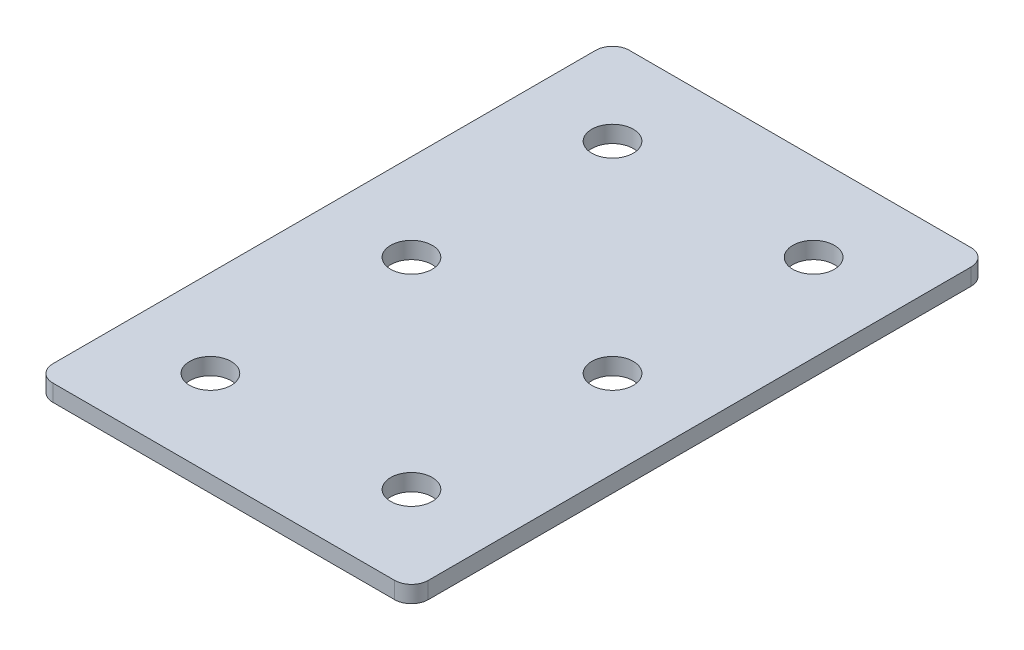
ISO-10303-21;
HEADER;
FILE_DESCRIPTION(('STEP AP214'),'2;1');
FILE_NAME('part.step','',(''),(''),'','','');
FILE_SCHEMA(('AUTOMOTIVE_DESIGN { 1 0 10303 214 1 1 1 1 }'));
ENDSEC;
DATA;
#1=APPLICATION_CONTEXT('core data for automotive mechanical design processes');
#2=APPLICATION_PROTOCOL_DEFINITION('international standard','automotive_design',2000,#1);
#3=PRODUCT_CONTEXT('',#1,'mechanical');
#4=PRODUCT('Part','Part','',(#3));
#5=PRODUCT_RELATED_PRODUCT_CATEGORY('part','',(#4));
#6=PRODUCT_DEFINITION_FORMATION('','',#4);
#7=PRODUCT_DEFINITION_CONTEXT('part definition',#1,'design');
#8=PRODUCT_DEFINITION('design','',#6,#7);
#9=PRODUCT_DEFINITION_SHAPE('','',#8);
#10=(LENGTH_UNIT() NAMED_UNIT(*) SI_UNIT(.MILLI.,.METRE.));
#11=(NAMED_UNIT(*) PLANE_ANGLE_UNIT() SI_UNIT($,.RADIAN.));
#12=(NAMED_UNIT(*) SI_UNIT($,.STERADIAN.) SOLID_ANGLE_UNIT());
#13=UNCERTAINTY_MEASURE_WITH_UNIT(LENGTH_MEASURE(1.E-05),#10,'distance_accuracy_value','');
#14=(GEOMETRIC_REPRESENTATION_CONTEXT(3) GLOBAL_UNCERTAINTY_ASSIGNED_CONTEXT((#13)) GLOBAL_UNIT_ASSIGNED_CONTEXT((#10,
#11,#12)) REPRESENTATION_CONTEXT('',''));
#15=CARTESIAN_POINT('',(0.,0.,0.));
#16=DIRECTION('',(0.,0.,1.));
#17=DIRECTION('',(1.,0.,0.));
#18=AXIS2_PLACEMENT_3D('',#15,#16,#17);
#19=CARTESIAN_POINT('',(-1.64111741986516,1.45798729371791,-31.0664297859648));
#20=DIRECTION('',(0.,-1.,0.));
#21=DIRECTION('',(0.,0.,-1.));
#22=AXIS2_PLACEMENT_3D('',#19,#20,#21);
#23=PLANE('',#22);
#24=CARTESIAN_POINT('',(13.3588825801348,1.45798729371791,28.9335702140352));
#25=DIRECTION('',(0.,1.,0.));
#26=DIRECTION('',(0.,0.,1.));
#27=AXIS2_PLACEMENT_3D('',#24,#25,#26);
#28=CIRCLE('',#27,3.1);
#29=CARTESIAN_POINT('',(13.3588825801348,1.45798729371791,32.0335702140352));
#30=VERTEX_POINT('',#29);
#31=EDGE_CURVE('E177',#30,#30,#28,.T.);
#32=ORIENTED_EDGE('',*,*,#31,.T.);
#33=EDGE_LOOP('',(#32));
#34=FACE_BOUND('',#33,.T.);
#35=CARTESIAN_POINT('',(-16.6411174198652,1.45798729371791,28.9335702140352));
#36=DIRECTION('',(0.,1.,0.));
#37=DIRECTION('',(0.,0.,1.));
#38=AXIS2_PLACEMENT_3D('',#35,#36,#37);
#39=CIRCLE('',#38,3.1);
#40=CARTESIAN_POINT('',(-16.6411174198652,1.45798729371791,32.0335702140352));
#41=VERTEX_POINT('',#40);
#42=EDGE_CURVE('E171',#41,#41,#39,.T.);
#43=ORIENTED_EDGE('',*,*,#42,.T.);
#44=EDGE_LOOP('',(#43));
#45=FACE_BOUND('',#44,.T.);
#46=CARTESIAN_POINT('',(13.3588825801348,1.45798729371791,-1.06642978596477));
#47=DIRECTION('',(0.,1.,0.));
#48=DIRECTION('',(0.,0.,1.));
#49=AXIS2_PLACEMENT_3D('',#46,#47,#48);
#50=CIRCLE('',#49,3.1);
#51=CARTESIAN_POINT('',(13.3588825801348,1.45798729371791,2.03357021403523));
#52=VERTEX_POINT('',#51);
#53=EDGE_CURVE('E165',#52,#52,#50,.T.);
#54=ORIENTED_EDGE('',*,*,#53,.T.);
#55=EDGE_LOOP('',(#54));
#56=FACE_BOUND('',#55,.T.);
#57=CARTESIAN_POINT('',(-16.6411174198652,1.45798729371791,-1.06642978596477));
#58=DIRECTION('',(0.,1.,0.));
#59=DIRECTION('',(0.,0.,1.));
#60=AXIS2_PLACEMENT_3D('',#57,#58,#59);
#61=CIRCLE('',#60,3.1);
#62=CARTESIAN_POINT('',(-16.6411174198652,1.45798729371791,2.03357021403523));
#63=VERTEX_POINT('',#62);
#64=EDGE_CURVE('E159',#63,#63,#61,.T.);
#65=ORIENTED_EDGE('',*,*,#64,.T.);
#66=EDGE_LOOP('',(#65));
#67=FACE_BOUND('',#66,.T.);
#68=CARTESIAN_POINT('',(13.3588825801349,1.45798729371791,-31.0664297859648));
#69=DIRECTION('',(0.,1.,0.));
#70=DIRECTION('',(0.,0.,1.));
#71=AXIS2_PLACEMENT_3D('',#68,#69,#70);
#72=CIRCLE('',#71,3.1);
#73=CARTESIAN_POINT('',(13.3588825801349,1.45798729371791,-27.9664297859648));
#74=VERTEX_POINT('',#73);
#75=EDGE_CURVE('E154',#74,#74,#72,.T.);
#76=ORIENTED_EDGE('',*,*,#75,.T.);
#77=EDGE_LOOP('',(#76));
#78=FACE_BOUND('',#77,.T.);
#79=CARTESIAN_POINT('',(-16.6411174198652,1.45798729371791,-31.0664297859648));
#80=DIRECTION('',(0.,1.,0.));
#81=DIRECTION('',(0.,0.,1.));
#82=AXIS2_PLACEMENT_3D('',#79,#80,#81);
#83=CIRCLE('',#82,3.1);
#84=CARTESIAN_POINT('',(-16.6411174198652,1.45798729371791,-27.9664297859648));
#85=VERTEX_POINT('',#84);
#86=EDGE_CURVE('E147',#85,#85,#83,.T.);
#87=ORIENTED_EDGE('',*,*,#86,.T.);
#88=EDGE_LOOP('',(#87));
#89=FACE_BOUND('',#88,.T.);
#90=DIRECTION('',(0.,0.,-1.));
#91=VECTOR('',#90,1.);
#92=CARTESIAN_POINT('',(26.3588825801349,1.45798729371791,41.9335702140352));
#93=LINE('',#92,#91);
#94=CARTESIAN_POINT('',(26.3588825801349,1.45798729371791,39.4335702140352));
#95=VERTEX_POINT('',#94);
#96=CARTESIAN_POINT('',(26.3588825801349,1.45798729371791,-41.5664297859648));
#97=VERTEX_POINT('',#96);
#98=EDGE_CURVE('E106',#95,#97,#93,.T.);
#99=ORIENTED_EDGE('',*,*,#98,.F.);
#100=CARTESIAN_POINT('',(23.8588825801349,1.45798729371791,39.4335702140352));
#101=DIRECTION('',(0.,-1.,0.));
#102=DIRECTION('',(0.,0.,-1.));
#103=AXIS2_PLACEMENT_3D('',#100,#101,#102);
#104=CIRCLE('',#103,2.5);
#105=CARTESIAN_POINT('',(23.8588825801349,1.45798729371791,41.9335702140352));
#106=VERTEX_POINT('',#105);
#107=EDGE_CURVE('E128',#95,#106,#104,.T.);
#108=ORIENTED_EDGE('',*,*,#107,.T.);
#109=DIRECTION('',(1.,0.,0.));
#110=VECTOR('',#109,1.);
#111=CARTESIAN_POINT('',(-29.6411174198653,1.45798729371791,41.9335702140352));
#112=LINE('',#111,#110);
#113=CARTESIAN_POINT('',(-27.1411174198653,1.45798729371791,41.9335702140352));
#114=VERTEX_POINT('',#113);
#115=EDGE_CURVE('E110',#114,#106,#112,.T.);
#116=ORIENTED_EDGE('',*,*,#115,.F.);
#117=CARTESIAN_POINT('',(-27.1411174198653,1.45798729371791,39.4335702140352));
#118=DIRECTION('',(0.,-1.,0.));
#119=DIRECTION('',(0.,0.,-1.));
#120=AXIS2_PLACEMENT_3D('',#117,#118,#119);
#121=CIRCLE('',#120,2.5);
#122=CARTESIAN_POINT('',(-29.6411174198653,1.45798729371791,39.4335702140352));
#123=VERTEX_POINT('',#122);
#124=EDGE_CURVE('E105',#114,#123,#121,.T.);
#125=ORIENTED_EDGE('',*,*,#124,.T.);
#126=DIRECTION('',(0.,0.,1.));
#127=VECTOR('',#126,1.);
#128=CARTESIAN_POINT('',(-29.6411174198653,1.45798729371791,-44.0664297859648));
#129=LINE('',#128,#127);
#130=CARTESIAN_POINT('',(-29.6411174198653,1.45798729371791,-41.5664297859648));
#131=VERTEX_POINT('',#130);
#132=EDGE_CURVE('E137',#131,#123,#129,.T.);
#133=ORIENTED_EDGE('',*,*,#132,.F.);
#134=CARTESIAN_POINT('',(-27.1411174198653,1.45798729371791,-41.5664297859648));
#135=DIRECTION('',(0.,-1.,0.));
#136=DIRECTION('',(0.,0.,-1.));
#137=AXIS2_PLACEMENT_3D('',#134,#135,#136);
#138=CIRCLE('',#137,2.5);
#139=CARTESIAN_POINT('',(-27.1411174198653,1.45798729371791,-44.0664297859648));
#140=VERTEX_POINT('',#139);
#141=EDGE_CURVE('E31',#131,#140,#138,.T.);
#142=ORIENTED_EDGE('',*,*,#141,.T.);
#143=DIRECTION('',(-1.,0.,0.));
#144=VECTOR('',#143,1.);
#145=CARTESIAN_POINT('',(26.3588825801349,1.45798729371791,-44.0664297859648));
#146=LINE('',#145,#144);
#147=CARTESIAN_POINT('',(23.8588825801349,1.45798729371791,-44.0664297859648));
#148=VERTEX_POINT('',#147);
#149=EDGE_CURVE('E138',#148,#140,#146,.T.);
#150=ORIENTED_EDGE('',*,*,#149,.F.);
#151=CARTESIAN_POINT('',(23.8588825801349,1.45798729371791,-41.5664297859648));
#152=DIRECTION('',(0.,-1.,0.));
#153=DIRECTION('',(0.,0.,-1.));
#154=AXIS2_PLACEMENT_3D('',#151,#152,#153);
#155=CIRCLE('',#154,2.5);
#156=EDGE_CURVE('E126',#148,#97,#155,.T.);
#157=ORIENTED_EDGE('',*,*,#156,.T.);
#158=EDGE_LOOP('',(#99,#108,#116,#125,#133,#142,#150,#157));
#159=FACE_BOUND('',#158,.T.);
#160=ADVANCED_FACE('F16',(#34,#45,#56,#67,#78,#89,#159),#23,.T.);
#161=CARTESIAN_POINT('',(26.3588825801349,1.45798729371791,-44.0664297859648));
#162=DIRECTION('',(0.,0.,-1.));
#163=DIRECTION('',(-1.,0.,0.));
#164=AXIS2_PLACEMENT_3D('',#161,#162,#163);
#165=PLANE('',#164);
#166=DIRECTION('',(-1.,0.,0.));
#167=VECTOR('',#166,1.);
#168=CARTESIAN_POINT('',(26.3588825801349,3.95798729371791,-44.0664297859648));
#169=LINE('',#168,#167);
#170=CARTESIAN_POINT('',(23.8588825801349,3.95798729371791,-44.0664297859648));
#171=VERTEX_POINT('',#170);
#172=CARTESIAN_POINT('',(-27.1411174198653,3.95798729371791,-44.0664297859648));
#173=VERTEX_POINT('',#172);
#174=EDGE_CURVE('E144',#171,#173,#169,.T.);
#175=ORIENTED_EDGE('',*,*,#174,.F.);
#176=DIRECTION('',(0.,1.,0.));
#177=VECTOR('',#176,1.);
#178=CARTESIAN_POINT('',(23.8588825801349,1.45798729371791,-44.0664297859648));
#179=LINE('',#178,#177);
#180=EDGE_CURVE('E38',#171,#148,#179,.F.);
#181=ORIENTED_EDGE('',*,*,#180,.T.);
#182=ORIENTED_EDGE('',*,*,#149,.T.);
#183=DIRECTION('',(0.,1.,0.));
#184=VECTOR('',#183,1.);
#185=CARTESIAN_POINT('',(-27.1411174198653,1.45798729371791,-44.0664297859648));
#186=LINE('',#185,#184);
#187=EDGE_CURVE('E130',#140,#173,#186,.T.);
#188=ORIENTED_EDGE('',*,*,#187,.T.);
#189=EDGE_LOOP('',(#175,#181,#182,#188));
#190=FACE_BOUND('',#189,.T.);
#191=ADVANCED_FACE('F223',(#190),#165,.T.);
#192=CARTESIAN_POINT('',(26.3588825801349,1.45798729371791,41.9335702140352));
#193=DIRECTION('',(1.,0.,0.));
#194=DIRECTION('',(0.,0.,-1.));
#195=AXIS2_PLACEMENT_3D('',#192,#193,#194);
#196=PLANE('',#195);
#197=DIRECTION('',(0.,0.,-1.));
#198=VECTOR('',#197,1.);
#199=CARTESIAN_POINT('',(26.3588825801349,3.95798729371791,41.9335702140352));
#200=LINE('',#199,#198);
#201=CARTESIAN_POINT('',(26.3588825801349,3.95798729371791,39.4335702140352));
#202=VERTEX_POINT('',#201);
#203=CARTESIAN_POINT('',(26.3588825801349,3.95798729371791,-41.5664297859648));
#204=VERTEX_POINT('',#203);
#205=EDGE_CURVE('E102',#202,#204,#200,.T.);
#206=ORIENTED_EDGE('',*,*,#205,.F.);
#207=DIRECTION('',(0.,1.,0.));
#208=VECTOR('',#207,1.);
#209=CARTESIAN_POINT('',(26.3588825801349,1.45798729371791,39.4335702140352));
#210=LINE('',#209,#208);
#211=EDGE_CURVE('E122',#202,#95,#210,.F.);
#212=ORIENTED_EDGE('',*,*,#211,.T.);
#213=ORIENTED_EDGE('',*,*,#98,.T.);
#214=DIRECTION('',(0.,1.,0.));
#215=VECTOR('',#214,1.);
#216=CARTESIAN_POINT('',(26.3588825801349,1.45798729371791,-41.5664297859648));
#217=LINE('',#216,#215);
#218=EDGE_CURVE('E119',#97,#204,#217,.T.);
#219=ORIENTED_EDGE('',*,*,#218,.T.);
#220=EDGE_LOOP('',(#206,#212,#213,#219));
#221=FACE_BOUND('',#220,.T.);
#222=ADVANCED_FACE('F228',(#221),#196,.T.);
#223=CARTESIAN_POINT('',(-29.6411174198653,1.45798729371791,41.9335702140352));
#224=DIRECTION('',(0.,0.,1.));
#225=DIRECTION('',(1.,0.,0.));
#226=AXIS2_PLACEMENT_3D('',#223,#224,#225);
#227=PLANE('',#226);
#228=ORIENTED_EDGE('',*,*,#115,.T.);
#229=DIRECTION('',(0.,1.,0.));
#230=VECTOR('',#229,1.);
#231=CARTESIAN_POINT('',(23.8588825801349,1.45798729371791,41.9335702140352));
#232=LINE('',#231,#230);
#233=CARTESIAN_POINT('',(23.8588825801349,3.95798729371791,41.9335702140352));
#234=VERTEX_POINT('',#233);
#235=EDGE_CURVE('E93',#106,#234,#232,.T.);
#236=ORIENTED_EDGE('',*,*,#235,.T.);
#237=DIRECTION('',(1.,0.,0.));
#238=VECTOR('',#237,1.);
#239=CARTESIAN_POINT('',(-29.6411174198653,3.95798729371791,41.9335702140352));
#240=LINE('',#239,#238);
#241=CARTESIAN_POINT('',(-27.1411174198653,3.95798729371791,41.9335702140352));
#242=VERTEX_POINT('',#241);
#243=EDGE_CURVE('E85',#242,#234,#240,.T.);
#244=ORIENTED_EDGE('',*,*,#243,.F.);
#245=DIRECTION('',(0.,1.,0.));
#246=VECTOR('',#245,1.);
#247=CARTESIAN_POINT('',(-27.1411174198653,1.45798729371791,41.9335702140352));
#248=LINE('',#247,#246);
#249=EDGE_CURVE('E99',#242,#114,#248,.F.);
#250=ORIENTED_EDGE('',*,*,#249,.T.);
#251=EDGE_LOOP('',(#228,#236,#244,#250));
#252=FACE_BOUND('',#251,.T.);
#253=ADVANCED_FACE('F98',(#252),#227,.T.);
#254=CARTESIAN_POINT('',(-29.6411174198653,1.45798729371791,-44.0664297859648));
#255=DIRECTION('',(-1.,0.,0.));
#256=DIRECTION('',(0.,0.,1.));
#257=AXIS2_PLACEMENT_3D('',#254,#255,#256);
#258=PLANE('',#257);
#259=DIRECTION('',(0.,0.,1.));
#260=VECTOR('',#259,1.);
#261=CARTESIAN_POINT('',(-29.6411174198653,3.95798729371791,-44.0664297859648));
#262=LINE('',#261,#260);
#263=CARTESIAN_POINT('',(-29.6411174198653,3.95798729371791,-41.5664297859648));
#264=VERTEX_POINT('',#263);
#265=CARTESIAN_POINT('',(-29.6411174198653,3.95798729371791,39.4335702140352));
#266=VERTEX_POINT('',#265);
#267=EDGE_CURVE('E87',#264,#266,#262,.T.);
#268=ORIENTED_EDGE('',*,*,#267,.F.);
#269=DIRECTION('',(0.,1.,0.));
#270=VECTOR('',#269,1.);
#271=CARTESIAN_POINT('',(-29.6411174198653,1.45798729371791,-41.5664297859648));
#272=LINE('',#271,#270);
#273=EDGE_CURVE('E10',#264,#131,#272,.F.);
#274=ORIENTED_EDGE('',*,*,#273,.T.);
#275=ORIENTED_EDGE('',*,*,#132,.T.);
#276=DIRECTION('',(0.,1.,0.));
#277=VECTOR('',#276,1.);
#278=CARTESIAN_POINT('',(-29.6411174198653,1.45798729371791,39.4335702140352));
#279=LINE('',#278,#277);
#280=EDGE_CURVE('E24',#123,#266,#279,.T.);
#281=ORIENTED_EDGE('',*,*,#280,.T.);
#282=EDGE_LOOP('',(#268,#274,#275,#281));
#283=FACE_BOUND('',#282,.T.);
#284=ADVANCED_FACE('F135',(#283),#258,.T.);
#285=CARTESIAN_POINT('',(-1.64111741986516,3.95798729371791,-31.0664297859648));
#286=DIRECTION('',(0.,-1.,0.));
#287=DIRECTION('',(0.,0.,-1.));
#288=AXIS2_PLACEMENT_3D('',#285,#286,#287);
#289=PLANE('',#288);
#290=CARTESIAN_POINT('',(13.3588825801348,3.95798729371791,28.9335702140352));
#291=DIRECTION('',(0.,1.,0.));
#292=DIRECTION('',(0.,0.,1.));
#293=AXIS2_PLACEMENT_3D('',#290,#291,#292);
#294=CIRCLE('',#293,3.1);
#295=CARTESIAN_POINT('',(13.3588825801348,3.95798729371791,32.0335702140352));
#296=VERTEX_POINT('',#295);
#297=EDGE_CURVE('E180',#296,#296,#294,.T.);
#298=ORIENTED_EDGE('',*,*,#297,.F.);
#299=EDGE_LOOP('',(#298));
#300=FACE_BOUND('',#299,.T.);
#301=CARTESIAN_POINT('',(-16.6411174198652,3.95798729371791,28.9335702140352));
#302=DIRECTION('',(0.,1.,0.));
#303=DIRECTION('',(0.,0.,1.));
#304=AXIS2_PLACEMENT_3D('',#301,#302,#303);
#305=CIRCLE('',#304,3.1);
#306=CARTESIAN_POINT('',(-16.6411174198652,3.95798729371791,32.0335702140352));
#307=VERTEX_POINT('',#306);
#308=EDGE_CURVE('E174',#307,#307,#305,.T.);
#309=ORIENTED_EDGE('',*,*,#308,.F.);
#310=EDGE_LOOP('',(#309));
#311=FACE_BOUND('',#310,.T.);
#312=CARTESIAN_POINT('',(13.3588825801348,3.95798729371791,-1.06642978596477));
#313=DIRECTION('',(0.,1.,0.));
#314=DIRECTION('',(0.,0.,1.));
#315=AXIS2_PLACEMENT_3D('',#312,#313,#314);
#316=CIRCLE('',#315,3.1);
#317=CARTESIAN_POINT('',(13.3588825801348,3.95798729371791,2.03357021403523));
#318=VERTEX_POINT('',#317);
#319=EDGE_CURVE('E168',#318,#318,#316,.T.);
#320=ORIENTED_EDGE('',*,*,#319,.F.);
#321=EDGE_LOOP('',(#320));
#322=FACE_BOUND('',#321,.T.);
#323=CARTESIAN_POINT('',(-16.6411174198652,3.95798729371791,-1.06642978596477));
#324=DIRECTION('',(0.,1.,0.));
#325=DIRECTION('',(0.,0.,1.));
#326=AXIS2_PLACEMENT_3D('',#323,#324,#325);
#327=CIRCLE('',#326,3.1);
#328=CARTESIAN_POINT('',(-16.6411174198652,3.95798729371791,2.03357021403523));
#329=VERTEX_POINT('',#328);
#330=EDGE_CURVE('E162',#329,#329,#327,.T.);
#331=ORIENTED_EDGE('',*,*,#330,.F.);
#332=EDGE_LOOP('',(#331));
#333=FACE_BOUND('',#332,.T.);
#334=CARTESIAN_POINT('',(13.3588825801349,3.95798729371791,-31.0664297859648));
#335=DIRECTION('',(0.,1.,0.));
#336=DIRECTION('',(0.,0.,1.));
#337=AXIS2_PLACEMENT_3D('',#334,#335,#336);
#338=CIRCLE('',#337,3.1);
#339=CARTESIAN_POINT('',(13.3588825801349,3.95798729371791,-27.9664297859648));
#340=VERTEX_POINT('',#339);
#341=EDGE_CURVE('E156',#340,#340,#338,.T.);
#342=ORIENTED_EDGE('',*,*,#341,.F.);
#343=EDGE_LOOP('',(#342));
#344=FACE_BOUND('',#343,.T.);
#345=CARTESIAN_POINT('',(-16.6411174198652,3.95798729371791,-31.0664297859648));
#346=DIRECTION('',(0.,1.,0.));
#347=DIRECTION('',(0.,0.,1.));
#348=AXIS2_PLACEMENT_3D('',#345,#346,#347);
#349=CIRCLE('',#348,3.1);
#350=CARTESIAN_POINT('',(-16.6411174198652,3.95798729371791,-27.9664297859648));
#351=VERTEX_POINT('',#350);
#352=EDGE_CURVE('E149',#351,#351,#349,.T.);
#353=ORIENTED_EDGE('',*,*,#352,.F.);
#354=EDGE_LOOP('',(#353));
#355=FACE_BOUND('',#354,.T.);
#356=ORIENTED_EDGE('',*,*,#243,.T.);
#357=CARTESIAN_POINT('',(23.8588825801349,3.95798729371791,39.4335702140352));
#358=DIRECTION('',(0.,-1.,0.));
#359=DIRECTION('',(0.,0.,-1.));
#360=AXIS2_PLACEMENT_3D('',#357,#358,#359);
#361=CIRCLE('',#360,2.5);
#362=EDGE_CURVE('E117',#234,#202,#361,.F.);
#363=ORIENTED_EDGE('',*,*,#362,.T.);
#364=ORIENTED_EDGE('',*,*,#205,.T.);
#365=CARTESIAN_POINT('',(23.8588825801349,3.95798729371791,-41.5664297859648));
#366=DIRECTION('',(0.,-1.,0.));
#367=DIRECTION('',(0.,0.,-1.));
#368=AXIS2_PLACEMENT_3D('',#365,#366,#367);
#369=CIRCLE('',#368,2.5);
#370=EDGE_CURVE('E115',#204,#171,#369,.F.);
#371=ORIENTED_EDGE('',*,*,#370,.T.);
#372=ORIENTED_EDGE('',*,*,#174,.T.);
#373=CARTESIAN_POINT('',(-27.1411174198653,3.95798729371791,-41.5664297859648));
#374=DIRECTION('',(0.,-1.,0.));
#375=DIRECTION('',(0.,0.,-1.));
#376=AXIS2_PLACEMENT_3D('',#373,#374,#375);
#377=CIRCLE('',#376,2.5);
#378=EDGE_CURVE('E92',#173,#264,#377,.F.);
#379=ORIENTED_EDGE('',*,*,#378,.T.);
#380=ORIENTED_EDGE('',*,*,#267,.T.);
#381=CARTESIAN_POINT('',(-27.1411174198653,3.95798729371791,39.4335702140352));
#382=DIRECTION('',(0.,-1.,0.));
#383=DIRECTION('',(0.,0.,-1.));
#384=AXIS2_PLACEMENT_3D('',#381,#382,#383);
#385=CIRCLE('',#384,2.5);
#386=EDGE_CURVE('E82',#266,#242,#385,.F.);
#387=ORIENTED_EDGE('',*,*,#386,.T.);
#388=EDGE_LOOP('',(#356,#363,#364,#371,#372,#379,#380,#387));
#389=FACE_BOUND('',#388,.T.);
#390=ADVANCED_FACE('F84',(#300,#311,#322,#333,#344,#355,#389),#289,.F.);
#391=CARTESIAN_POINT('',(-16.6411174198652,1.45798729371791,-31.0664297859648));
#392=DIRECTION('',(0.,1.,0.));
#393=DIRECTION('',(0.,0.,1.));
#394=AXIS2_PLACEMENT_3D('',#391,#392,#393);
#395=CYLINDRICAL_SURFACE('',#394,3.1);
#396=ORIENTED_EDGE('',*,*,#86,.F.);
#397=EDGE_LOOP('',(#396));
#398=FACE_BOUND('',#397,.T.);
#399=ORIENTED_EDGE('',*,*,#352,.T.);
#400=EDGE_LOOP('',(#399));
#401=FACE_BOUND('',#400,.T.);
#402=ADVANCED_FACE('F198',(#398,#401),#395,.F.);
#403=CARTESIAN_POINT('',(13.3588825801349,1.45798729371791,-31.0664297859648));
#404=DIRECTION('',(0.,1.,0.));
#405=DIRECTION('',(0.,0.,1.));
#406=AXIS2_PLACEMENT_3D('',#403,#404,#405);
#407=CYLINDRICAL_SURFACE('',#406,3.1);
#408=ORIENTED_EDGE('',*,*,#75,.F.);
#409=EDGE_LOOP('',(#408));
#410=FACE_BOUND('',#409,.T.);
#411=ORIENTED_EDGE('',*,*,#341,.T.);
#412=EDGE_LOOP('',(#411));
#413=FACE_BOUND('',#412,.T.);
#414=ADVANCED_FACE('F211',(#410,#413),#407,.F.);
#415=CARTESIAN_POINT('',(-16.6411174198652,1.45798729371791,-1.06642978596477));
#416=DIRECTION('',(0.,1.,0.));
#417=DIRECTION('',(0.,0.,1.));
#418=AXIS2_PLACEMENT_3D('',#415,#416,#417);
#419=CYLINDRICAL_SURFACE('',#418,3.1);
#420=ORIENTED_EDGE('',*,*,#64,.F.);
#421=EDGE_LOOP('',(#420));
#422=FACE_BOUND('',#421,.T.);
#423=ORIENTED_EDGE('',*,*,#330,.T.);
#424=EDGE_LOOP('',(#423));
#425=FACE_BOUND('',#424,.T.);
#426=ADVANCED_FACE('F218',(#422,#425),#419,.F.);
#427=CARTESIAN_POINT('',(13.3588825801348,1.45798729371791,-1.06642978596477));
#428=DIRECTION('',(0.,1.,0.));
#429=DIRECTION('',(0.,0.,1.));
#430=AXIS2_PLACEMENT_3D('',#427,#428,#429);
#431=CYLINDRICAL_SURFACE('',#430,3.1);
#432=ORIENTED_EDGE('',*,*,#53,.F.);
#433=EDGE_LOOP('',(#432));
#434=FACE_BOUND('',#433,.T.);
#435=ORIENTED_EDGE('',*,*,#319,.T.);
#436=EDGE_LOOP('',(#435));
#437=FACE_BOUND('',#436,.T.);
#438=ADVANCED_FACE('F291',(#434,#437),#431,.F.);
#439=CARTESIAN_POINT('',(-16.6411174198652,1.45798729371791,28.9335702140352));
#440=DIRECTION('',(0.,1.,0.));
#441=DIRECTION('',(0.,0.,1.));
#442=AXIS2_PLACEMENT_3D('',#439,#440,#441);
#443=CYLINDRICAL_SURFACE('',#442,3.1);
#444=ORIENTED_EDGE('',*,*,#42,.F.);
#445=EDGE_LOOP('',(#444));
#446=FACE_BOUND('',#445,.T.);
#447=ORIENTED_EDGE('',*,*,#308,.T.);
#448=EDGE_LOOP('',(#447));
#449=FACE_BOUND('',#448,.T.);
#450=ADVANCED_FACE('F192',(#446,#449),#443,.F.);
#451=CARTESIAN_POINT('',(13.3588825801348,1.45798729371791,28.9335702140352));
#452=DIRECTION('',(0.,1.,0.));
#453=DIRECTION('',(0.,0.,1.));
#454=AXIS2_PLACEMENT_3D('',#451,#452,#453);
#455=CYLINDRICAL_SURFACE('',#454,3.1);
#456=ORIENTED_EDGE('',*,*,#31,.F.);
#457=EDGE_LOOP('',(#456));
#458=FACE_BOUND('',#457,.T.);
#459=ORIENTED_EDGE('',*,*,#297,.T.);
#460=EDGE_LOOP('',(#459));
#461=FACE_BOUND('',#460,.T.);
#462=ADVANCED_FACE('F188',(#458,#461),#455,.F.);
#463=CARTESIAN_POINT('',(23.8588825801349,1.45798729371791,39.4335702140352));
#464=DIRECTION('',(0.,1.,0.));
#465=DIRECTION('',(0.,0.,1.));
#466=AXIS2_PLACEMENT_3D('',#463,#464,#465);
#467=CYLINDRICAL_SURFACE('',#466,2.5);
#468=ORIENTED_EDGE('',*,*,#107,.F.);
#469=ORIENTED_EDGE('',*,*,#211,.F.);
#470=ORIENTED_EDGE('',*,*,#362,.F.);
#471=ORIENTED_EDGE('',*,*,#235,.F.);
#472=EDGE_LOOP('',(#468,#469,#470,#471));
#473=FACE_BOUND('',#472,.T.);
#474=ADVANCED_FACE('F191',(#473),#467,.T.);
#475=CARTESIAN_POINT('',(23.8588825801349,1.45798729371791,-41.5664297859648));
#476=DIRECTION('',(0.,1.,0.));
#477=DIRECTION('',(0.,0.,1.));
#478=AXIS2_PLACEMENT_3D('',#475,#476,#477);
#479=CYLINDRICAL_SURFACE('',#478,2.5);
#480=ORIENTED_EDGE('',*,*,#156,.F.);
#481=ORIENTED_EDGE('',*,*,#180,.F.);
#482=ORIENTED_EDGE('',*,*,#370,.F.);
#483=ORIENTED_EDGE('',*,*,#218,.F.);
#484=EDGE_LOOP('',(#480,#481,#482,#483));
#485=FACE_BOUND('',#484,.T.);
#486=ADVANCED_FACE('F233',(#485),#479,.T.);
#487=CARTESIAN_POINT('',(-27.1411174198653,1.45798729371791,-41.5664297859648));
#488=DIRECTION('',(0.,1.,0.));
#489=DIRECTION('',(0.,0.,1.));
#490=AXIS2_PLACEMENT_3D('',#487,#488,#489);
#491=CYLINDRICAL_SURFACE('',#490,2.5);
#492=ORIENTED_EDGE('',*,*,#141,.F.);
#493=ORIENTED_EDGE('',*,*,#273,.F.);
#494=ORIENTED_EDGE('',*,*,#378,.F.);
#495=ORIENTED_EDGE('',*,*,#187,.F.);
#496=EDGE_LOOP('',(#492,#493,#494,#495));
#497=FACE_BOUND('',#496,.T.);
#498=ADVANCED_FACE('F236',(#497),#491,.T.);
#499=CARTESIAN_POINT('',(-27.1411174198653,1.45798729371791,39.4335702140352));
#500=DIRECTION('',(0.,1.,0.));
#501=DIRECTION('',(0.,0.,1.));
#502=AXIS2_PLACEMENT_3D('',#499,#500,#501);
#503=CYLINDRICAL_SURFACE('',#502,2.5);
#504=ORIENTED_EDGE('',*,*,#124,.F.);
#505=ORIENTED_EDGE('',*,*,#249,.F.);
#506=ORIENTED_EDGE('',*,*,#386,.F.);
#507=ORIENTED_EDGE('',*,*,#280,.F.);
#508=EDGE_LOOP('',(#504,#505,#506,#507));
#509=FACE_BOUND('',#508,.T.);
#510=ADVANCED_FACE('F18',(#509),#503,.T.);
#511=CLOSED_SHELL('',(#160,#191,#222,#253,#284,#390,#402,#414,#426,#438,#450,#462,#474,#486,
#498,#510));
#512=MANIFOLD_SOLID_BREP('B1',#511);
#513=ADVANCED_BREP_SHAPE_REPRESENTATION('',(#18,#512),#14);
#514=SHAPE_DEFINITION_REPRESENTATION(#9,#513);
ENDSEC;
END-ISO-10303-21;
